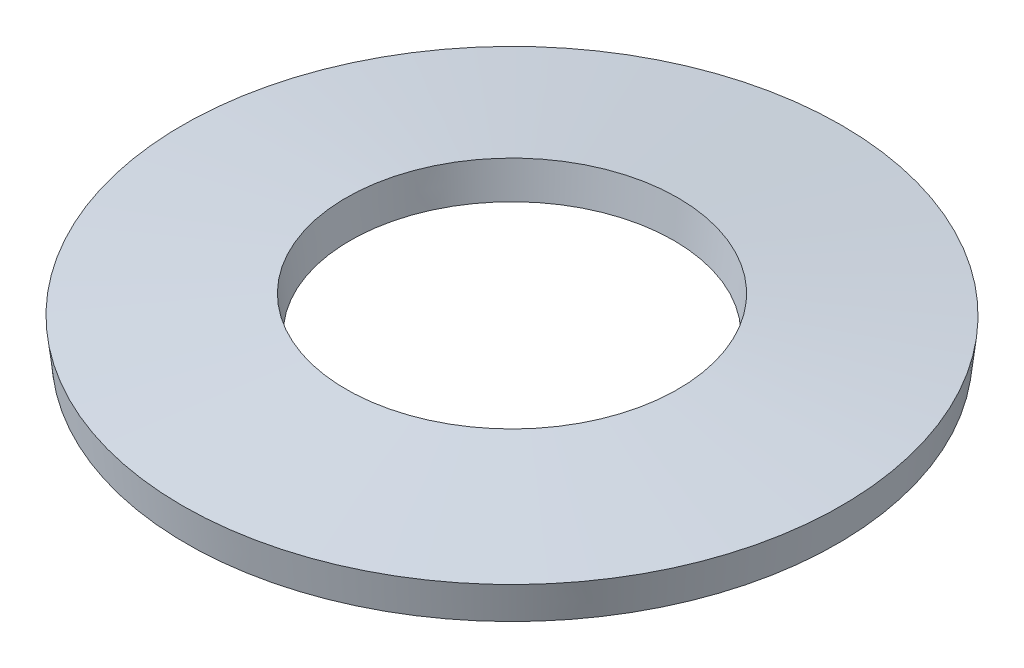
ISO-10303-21;
HEADER;
FILE_DESCRIPTION(('STEP AP214'),'2;1');
FILE_NAME('part.step','',(''),(''),'','','');
FILE_SCHEMA(('AUTOMOTIVE_DESIGN { 1 0 10303 214 1 1 1 1 }'));
ENDSEC;
DATA;
#1=APPLICATION_CONTEXT('core data for automotive mechanical design processes');
#2=APPLICATION_PROTOCOL_DEFINITION('international standard','automotive_design',2000,#1);
#3=PRODUCT_CONTEXT('',#1,'mechanical');
#4=PRODUCT('Part','Part','',(#3));
#5=PRODUCT_RELATED_PRODUCT_CATEGORY('part','',(#4));
#6=PRODUCT_DEFINITION_FORMATION('','',#4);
#7=PRODUCT_DEFINITION_CONTEXT('part definition',#1,'design');
#8=PRODUCT_DEFINITION('design','',#6,#7);
#9=PRODUCT_DEFINITION_SHAPE('','',#8);
#10=(LENGTH_UNIT() NAMED_UNIT(*) SI_UNIT(.MILLI.,.METRE.));
#11=(NAMED_UNIT(*) PLANE_ANGLE_UNIT() SI_UNIT($,.RADIAN.));
#12=(NAMED_UNIT(*) SI_UNIT($,.STERADIAN.) SOLID_ANGLE_UNIT());
#13=UNCERTAINTY_MEASURE_WITH_UNIT(LENGTH_MEASURE(1.E-05),#10,'distance_accuracy_value','');
#14=(GEOMETRIC_REPRESENTATION_CONTEXT(3) GLOBAL_UNCERTAINTY_ASSIGNED_CONTEXT((#13)) GLOBAL_UNIT_ASSIGNED_CONTEXT((#10,
#11,#12)) REPRESENTATION_CONTEXT('',''));
#15=CARTESIAN_POINT('',(0.,0.,0.));
#16=DIRECTION('',(0.,0.,1.));
#17=DIRECTION('',(1.,0.,0.));
#18=AXIS2_PLACEMENT_3D('',#15,#16,#17);
#19=CARTESIAN_POINT('',(0.,0.,0.));
#20=DIRECTION('',(0.,1.,0.));
#21=DIRECTION('',(0.,0.,1.));
#22=AXIS2_PLACEMENT_3D('',#19,#20,#21);
#23=CONICAL_SURFACE('',#22,3.5247623201318,0.11557915070243);
#24=CARTESIAN_POINT('',(0.,0.378458029757328,0.));
#25=DIRECTION('',(0.,-1.,0.));
#26=DIRECTION('',(0.,0.,-1.));
#27=AXIS2_PLACEMENT_3D('',#24,#25,#26);
#28=CIRCLE('',#27,3.5687);
#29=CARTESIAN_POINT('',(0.,0.378458029757328,-3.5687));
#30=VERTEX_POINT('',#29);
#31=EDGE_CURVE('E46',#30,#30,#28,.T.);
#32=ORIENTED_EDGE('',*,*,#31,.T.);
#33=EDGE_LOOP('',(#32));
#34=FACE_BOUND('',#33,.T.);
#35=CARTESIAN_POINT('',(0.,0.,0.));
#36=DIRECTION('',(0.,-1.,0.));
#37=DIRECTION('',(0.,0.,-1.));
#38=AXIS2_PLACEMENT_3D('',#35,#36,#37);
#39=CIRCLE('',#38,3.5247623201318);
#40=CARTESIAN_POINT('',(0.,0.,-3.5247623201318));
#41=VERTEX_POINT('',#40);
#42=EDGE_CURVE('E10',#41,#41,#39,.T.);
#43=ORIENTED_EDGE('',*,*,#42,.F.);
#44=EDGE_LOOP('',(#43));
#45=FACE_BOUND('',#44,.T.);
#46=ADVANCED_FACE('F32',(#34,#45),#23,.T.);
#47=CARTESIAN_POINT('',(0.,0.205741970242668,0.));
#48=DIRECTION('',(0.,-1.,0.));
#49=DIRECTION('',(0.,0.,-1.));
#50=AXIS2_PLACEMENT_3D('',#47,#48,#49);
#51=CONICAL_SURFACE('',#50,1.7526,1.45521717609247);
#52=ORIENTED_EDGE('',*,*,#42,.T.);
#53=EDGE_LOOP('',(#52));
#54=FACE_BOUND('',#53,.T.);
#55=CARTESIAN_POINT('',(0.,0.205741970242668,0.));
#56=DIRECTION('',(0.,-1.,0.));
#57=DIRECTION('',(0.,0.,-1.));
#58=AXIS2_PLACEMENT_3D('',#55,#56,#57);
#59=CIRCLE('',#58,1.7526);
#60=CARTESIAN_POINT('',(0.,0.205741970242668,-1.7526));
#61=VERTEX_POINT('',#60);
#62=EDGE_CURVE('E38',#61,#61,#59,.T.);
#63=ORIENTED_EDGE('',*,*,#62,.F.);
#64=EDGE_LOOP('',(#63));
#65=FACE_BOUND('',#64,.T.);
#66=ADVANCED_FACE('F62',(#54,#65),#51,.F.);
#67=CARTESIAN_POINT('',(0.,0.584199999999998,0.));
#68=DIRECTION('',(0.,1.,0.));
#69=DIRECTION('',(0.,0.,1.));
#70=AXIS2_PLACEMENT_3D('',#67,#68,#69);
#71=CONICAL_SURFACE('',#70,1.7965376798682,0.11557915070243);
#72=ORIENTED_EDGE('',*,*,#62,.T.);
#73=EDGE_LOOP('',(#72));
#74=FACE_BOUND('',#73,.T.);
#75=CARTESIAN_POINT('',(0.,0.584199999999998,0.));
#76=DIRECTION('',(0.,-1.,0.));
#77=DIRECTION('',(0.,0.,-1.));
#78=AXIS2_PLACEMENT_3D('',#75,#76,#77);
#79=CIRCLE('',#78,1.7965376798682);
#80=CARTESIAN_POINT('',(0.,0.584199999999998,-1.7965376798682));
#81=VERTEX_POINT('',#80);
#82=EDGE_CURVE('E42',#81,#81,#79,.T.);
#83=ORIENTED_EDGE('',*,*,#82,.F.);
#84=EDGE_LOOP('',(#83));
#85=FACE_BOUND('',#84,.T.);
#86=ADVANCED_FACE('F56',(#74,#85),#71,.F.);
#87=CARTESIAN_POINT('',(0.,0.378458029757328,0.));
#88=DIRECTION('',(0.,-1.,0.));
#89=DIRECTION('',(0.,0.,-1.));
#90=AXIS2_PLACEMENT_3D('',#87,#88,#89);
#91=CONICAL_SURFACE('',#90,3.5687,1.45521717609247);
#92=ORIENTED_EDGE('',*,*,#82,.T.);
#93=EDGE_LOOP('',(#92));
#94=FACE_BOUND('',#93,.T.);
#95=ORIENTED_EDGE('',*,*,#31,.F.);
#96=EDGE_LOOP('',(#95));
#97=FACE_BOUND('',#96,.T.);
#98=ADVANCED_FACE('F54',(#94,#97),#91,.T.);
#99=CLOSED_SHELL('',(#46,#66,#86,#98));
#100=MANIFOLD_SOLID_BREP('B2',#99);
#101=ADVANCED_BREP_SHAPE_REPRESENTATION('',(#18,#100),#14);
#102=SHAPE_DEFINITION_REPRESENTATION(#9,#101);
ENDSEC;
END-ISO-10303-21;
